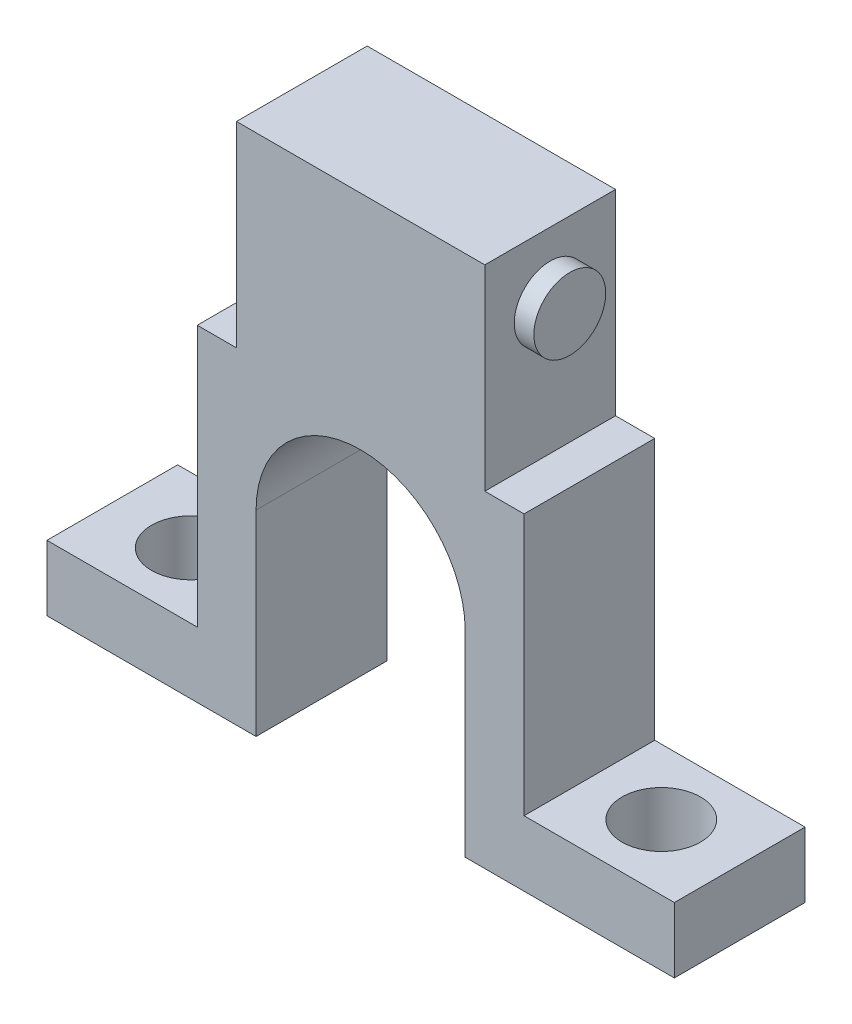
ISO-10303-21;
HEADER;
FILE_DESCRIPTION(('STEP AP214'),'2;1');
FILE_NAME('part.step','',(''),(''),'','','');
FILE_SCHEMA(('AUTOMOTIVE_DESIGN { 1 0 10303 214 1 1 1 1 }'));
ENDSEC;
DATA;
#1=APPLICATION_CONTEXT('core data for automotive mechanical design processes');
#2=APPLICATION_PROTOCOL_DEFINITION('international standard','automotive_design',2000,#1);
#3=PRODUCT_CONTEXT('',#1,'mechanical');
#4=PRODUCT('Part','Part','',(#3));
#5=PRODUCT_RELATED_PRODUCT_CATEGORY('part','',(#4));
#6=PRODUCT_DEFINITION_FORMATION('','',#4);
#7=PRODUCT_DEFINITION_CONTEXT('part definition',#1,'design');
#8=PRODUCT_DEFINITION('design','',#6,#7);
#9=PRODUCT_DEFINITION_SHAPE('','',#8);
#10=(LENGTH_UNIT() NAMED_UNIT(*) SI_UNIT(.MILLI.,.METRE.));
#11=(NAMED_UNIT(*) PLANE_ANGLE_UNIT() SI_UNIT($,.RADIAN.));
#12=(NAMED_UNIT(*) SI_UNIT($,.STERADIAN.) SOLID_ANGLE_UNIT());
#13=UNCERTAINTY_MEASURE_WITH_UNIT(LENGTH_MEASURE(1.E-05),#10,'distance_accuracy_value','');
#14=(GEOMETRIC_REPRESENTATION_CONTEXT(3) GLOBAL_UNCERTAINTY_ASSIGNED_CONTEXT((#13)) GLOBAL_UNIT_ASSIGNED_CONTEXT((#10,
#11,#12)) REPRESENTATION_CONTEXT('',''));
#15=CARTESIAN_POINT('',(0.,0.,0.));
#16=DIRECTION('',(0.,0.,1.));
#17=DIRECTION('',(1.,0.,0.));
#18=AXIS2_PLACEMENT_3D('',#15,#16,#17);
#19=CARTESIAN_POINT('',(0.,-22.5,0.));
#20=DIRECTION('',(0.,-1.,0.));
#21=DIRECTION('',(0.,0.,-1.));
#22=AXIS2_PLACEMENT_3D('',#19,#20,#21);
#23=PLANE('',#22);
#24=DIRECTION('',(0.,0.,1.));
#25=VECTOR('',#24,1.);
#26=CARTESIAN_POINT('',(-8.,-22.5,-5.));
#27=LINE('',#26,#25);
#28=CARTESIAN_POINT('',(-8.,-22.5,-5.));
#29=VERTEX_POINT('',#28);
#30=CARTESIAN_POINT('',(-8.,-22.5,5.));
#31=VERTEX_POINT('',#30);
#32=EDGE_CURVE('E227',#29,#31,#27,.T.);
#33=ORIENTED_EDGE('',*,*,#32,.T.);
#34=DIRECTION('',(-1.,0.,0.));
#35=VECTOR('',#34,1.);
#36=CARTESIAN_POINT('',(-24.,-22.5,5.));
#37=LINE('',#36,#35);
#38=CARTESIAN_POINT('',(-24.,-22.5,5.));
#39=VERTEX_POINT('',#38);
#40=EDGE_CURVE('E246',#31,#39,#37,.T.);
#41=ORIENTED_EDGE('',*,*,#40,.T.);
#42=DIRECTION('',(0.,0.,-1.));
#43=VECTOR('',#42,1.);
#44=CARTESIAN_POINT('',(-24.,-22.5,5.));
#45=LINE('',#44,#43);
#46=CARTESIAN_POINT('',(-24.,-22.5,-5.));
#47=VERTEX_POINT('',#46);
#48=EDGE_CURVE('E235',#39,#47,#45,.T.);
#49=ORIENTED_EDGE('',*,*,#48,.T.);
#50=DIRECTION('',(1.,0.,0.));
#51=VECTOR('',#50,1.);
#52=CARTESIAN_POINT('',(-24.,-22.5,-5.));
#53=LINE('',#52,#51);
#54=EDGE_CURVE('E240',#47,#29,#53,.T.);
#55=ORIENTED_EDGE('',*,*,#54,.T.);
#56=EDGE_LOOP('',(#33,#41,#49,#55));
#57=FACE_BOUND('',#56,.T.);
#58=CARTESIAN_POINT('',(-18.,-22.5,0.));
#59=DIRECTION('',(0.,1.,0.));
#60=DIRECTION('',(0.,0.,1.));
#61=AXIS2_PLACEMENT_3D('',#58,#59,#60);
#62=CIRCLE('',#61,3.);
#63=CARTESIAN_POINT('',(-18.,-22.5,3.));
#64=VERTEX_POINT('',#63);
#65=EDGE_CURVE('E224',#64,#64,#62,.T.);
#66=ORIENTED_EDGE('',*,*,#65,.T.);
#67=EDGE_LOOP('',(#66));
#68=FACE_BOUND('',#67,.T.);
#69=ADVANCED_FACE('F33',(#57,#68),#23,.T.);
#70=CARTESIAN_POINT('',(-9.5,17.5,5.));
#71=DIRECTION('',(1.,0.,0.));
#72=DIRECTION('',(0.,1.,0.));
#73=AXIS2_PLACEMENT_3D('',#70,#71,#72);
#74=PLANE('',#73);
#75=CARTESIAN_POINT('',(-9.5,12.5,0.));
#76=DIRECTION('',(1.,0.,0.));
#77=DIRECTION('',(0.,1.,0.));
#78=AXIS2_PLACEMENT_3D('',#75,#76,#77);
#79=CIRCLE('',#78,2.75);
#80=CARTESIAN_POINT('',(-9.5,15.25,0.));
#81=VERTEX_POINT('',#80);
#82=EDGE_CURVE('E11',#81,#81,#79,.F.);
#83=ORIENTED_EDGE('',*,*,#82,.F.);
#84=EDGE_LOOP('',(#83));
#85=FACE_BOUND('',#84,.T.);
#86=DIRECTION('',(0.,-1.,0.));
#87=VECTOR('',#86,1.);
#88=CARTESIAN_POINT('',(-9.5,17.5,-5.));
#89=LINE('',#88,#87);
#90=CARTESIAN_POINT('',(-9.5,17.5,-5.));
#91=VERTEX_POINT('',#90);
#92=CARTESIAN_POINT('',(-9.5,2.5,-5.));
#93=VERTEX_POINT('',#92);
#94=EDGE_CURVE('E141',#91,#93,#89,.T.);
#95=ORIENTED_EDGE('',*,*,#94,.T.);
#96=DIRECTION('',(0.,0.,-1.));
#97=VECTOR('',#96,1.);
#98=CARTESIAN_POINT('',(-9.5,2.5,5.));
#99=LINE('',#98,#97);
#100=CARTESIAN_POINT('',(-9.5,2.5,5.));
#101=VERTEX_POINT('',#100);
#102=EDGE_CURVE('E167',#101,#93,#99,.T.);
#103=ORIENTED_EDGE('',*,*,#102,.F.);
#104=DIRECTION('',(0.,-1.,0.));
#105=VECTOR('',#104,1.);
#106=CARTESIAN_POINT('',(-9.5,17.5,5.));
#107=LINE('',#106,#105);
#108=CARTESIAN_POINT('',(-9.5,17.5,5.));
#109=VERTEX_POINT('',#108);
#110=EDGE_CURVE('E156',#109,#101,#107,.T.);
#111=ORIENTED_EDGE('',*,*,#110,.F.);
#112=DIRECTION('',(0.,0.,-1.));
#113=VECTOR('',#112,1.);
#114=CARTESIAN_POINT('',(-9.5,17.5,5.));
#115=LINE('',#114,#113);
#116=EDGE_CURVE('E137',#109,#91,#115,.T.);
#117=ORIENTED_EDGE('',*,*,#116,.T.);
#118=EDGE_LOOP('',(#95,#103,#111,#117));
#119=FACE_BOUND('',#118,.T.);
#120=ADVANCED_FACE('F35',(#85,#119),#74,.F.);
#121=CARTESIAN_POINT('',(-9.5,2.5,5.));
#122=DIRECTION('',(0.,-1.,0.));
#123=DIRECTION('',(1.,0.,0.));
#124=AXIS2_PLACEMENT_3D('',#121,#122,#123);
#125=PLANE('',#124);
#126=DIRECTION('',(-1.,0.,0.));
#127=VECTOR('',#126,1.);
#128=CARTESIAN_POINT('',(-9.5,2.5,-5.));
#129=LINE('',#128,#127);
#130=CARTESIAN_POINT('',(-12.5,2.5,-5.));
#131=VERTEX_POINT('',#130);
#132=EDGE_CURVE('E144',#93,#131,#129,.T.);
#133=ORIENTED_EDGE('',*,*,#132,.T.);
#134=DIRECTION('',(0.,0.,-1.));
#135=VECTOR('',#134,1.);
#136=CARTESIAN_POINT('',(-12.5,2.5,5.));
#137=LINE('',#136,#135);
#138=CARTESIAN_POINT('',(-12.5,2.5,5.));
#139=VERTEX_POINT('',#138);
#140=EDGE_CURVE('E165',#139,#131,#137,.T.);
#141=ORIENTED_EDGE('',*,*,#140,.F.);
#142=DIRECTION('',(-1.,0.,0.));
#143=VECTOR('',#142,1.);
#144=CARTESIAN_POINT('',(-9.5,2.5,5.));
#145=LINE('',#144,#143);
#146=EDGE_CURVE('E97',#101,#139,#145,.T.);
#147=ORIENTED_EDGE('',*,*,#146,.F.);
#148=ORIENTED_EDGE('',*,*,#102,.T.);
#149=EDGE_LOOP('',(#133,#141,#147,#148));
#150=FACE_BOUND('',#149,.T.);
#151=ADVANCED_FACE('F191',(#150),#125,.F.);
#152=CARTESIAN_POINT('',(-12.5,2.5,5.));
#153=DIRECTION('',(1.,0.,0.));
#154=DIRECTION('',(0.,1.,0.));
#155=AXIS2_PLACEMENT_3D('',#152,#153,#154);
#156=PLANE('',#155);
#157=DIRECTION('',(0.,-1.,0.));
#158=VECTOR('',#157,1.);
#159=CARTESIAN_POINT('',(-12.5,2.5,-5.));
#160=LINE('',#159,#158);
#161=CARTESIAN_POINT('',(-12.5,-17.5,-5.));
#162=VERTEX_POINT('',#161);
#163=EDGE_CURVE('E147',#131,#162,#160,.T.);
#164=ORIENTED_EDGE('',*,*,#163,.T.);
#165=DIRECTION('',(0.,0.,-1.));
#166=VECTOR('',#165,1.);
#167=CARTESIAN_POINT('',(-12.5,-17.5,5.));
#168=LINE('',#167,#166);
#169=CARTESIAN_POINT('',(-12.5,-17.5,5.));
#170=VERTEX_POINT('',#169);
#171=EDGE_CURVE('E162',#170,#162,#168,.T.);
#172=ORIENTED_EDGE('',*,*,#171,.F.);
#173=DIRECTION('',(0.,-1.,0.));
#174=VECTOR('',#173,1.);
#175=CARTESIAN_POINT('',(-12.5,2.5,5.));
#176=LINE('',#175,#174);
#177=EDGE_CURVE('E279',#139,#170,#176,.T.);
#178=ORIENTED_EDGE('',*,*,#177,.F.);
#179=ORIENTED_EDGE('',*,*,#140,.T.);
#180=EDGE_LOOP('',(#164,#172,#178,#179));
#181=FACE_BOUND('',#180,.T.);
#182=ADVANCED_FACE('F287',(#181),#156,.F.);
#183=CARTESIAN_POINT('',(12.5,2.5,5.));
#184=DIRECTION('',(-1.,0.,0.));
#185=DIRECTION('',(0.,-1.,0.));
#186=AXIS2_PLACEMENT_3D('',#183,#184,#185);
#187=PLANE('',#186);
#188=DIRECTION('',(0.,1.,0.));
#189=VECTOR('',#188,1.);
#190=CARTESIAN_POINT('',(12.5,2.5,-5.));
#191=LINE('',#190,#189);
#192=CARTESIAN_POINT('',(12.5,-17.5,-5.));
#193=VERTEX_POINT('',#192);
#194=CARTESIAN_POINT('',(12.5,2.5,-5.));
#195=VERTEX_POINT('',#194);
#196=EDGE_CURVE('E150',#193,#195,#191,.T.);
#197=ORIENTED_EDGE('',*,*,#196,.T.);
#198=DIRECTION('',(0.,0.,-1.));
#199=VECTOR('',#198,1.);
#200=CARTESIAN_POINT('',(12.5,2.5,5.));
#201=LINE('',#200,#199);
#202=CARTESIAN_POINT('',(12.5,2.5,5.));
#203=VERTEX_POINT('',#202);
#204=EDGE_CURVE('E132',#203,#195,#201,.T.);
#205=ORIENTED_EDGE('',*,*,#204,.F.);
#206=DIRECTION('',(0.,1.,0.));
#207=VECTOR('',#206,1.);
#208=CARTESIAN_POINT('',(12.5,2.5,5.));
#209=LINE('',#208,#207);
#210=CARTESIAN_POINT('',(12.5,-17.5,5.));
#211=VERTEX_POINT('',#210);
#212=EDGE_CURVE('E120',#211,#203,#209,.T.);
#213=ORIENTED_EDGE('',*,*,#212,.F.);
#214=DIRECTION('',(0.,0.,-1.));
#215=VECTOR('',#214,1.);
#216=CARTESIAN_POINT('',(12.5,-17.5,5.));
#217=LINE('',#216,#215);
#218=EDGE_CURVE('E160',#211,#193,#217,.T.);
#219=ORIENTED_EDGE('',*,*,#218,.T.);
#220=EDGE_LOOP('',(#197,#205,#213,#219));
#221=FACE_BOUND('',#220,.T.);
#222=ADVANCED_FACE('F182',(#221),#187,.F.);
#223=CARTESIAN_POINT('',(9.5,2.5,5.));
#224=DIRECTION('',(0.,-1.,0.));
#225=DIRECTION('',(1.,0.,0.));
#226=AXIS2_PLACEMENT_3D('',#223,#224,#225);
#227=PLANE('',#226);
#228=DIRECTION('',(-1.,0.,0.));
#229=VECTOR('',#228,1.);
#230=CARTESIAN_POINT('',(9.5,2.5,-5.));
#231=LINE('',#230,#229);
#232=CARTESIAN_POINT('',(9.5,2.5,-5.));
#233=VERTEX_POINT('',#232);
#234=EDGE_CURVE('E129',#195,#233,#231,.T.);
#235=ORIENTED_EDGE('',*,*,#234,.T.);
#236=DIRECTION('',(0.,0.,-1.));
#237=VECTOR('',#236,1.);
#238=CARTESIAN_POINT('',(9.5,2.5,5.));
#239=LINE('',#238,#237);
#240=CARTESIAN_POINT('',(9.5,2.5,5.));
#241=VERTEX_POINT('',#240);
#242=EDGE_CURVE('E126',#241,#233,#239,.T.);
#243=ORIENTED_EDGE('',*,*,#242,.F.);
#244=DIRECTION('',(-1.,0.,0.));
#245=VECTOR('',#244,1.);
#246=CARTESIAN_POINT('',(9.5,2.5,5.));
#247=LINE('',#246,#245);
#248=EDGE_CURVE('E112',#203,#241,#247,.T.);
#249=ORIENTED_EDGE('',*,*,#248,.F.);
#250=ORIENTED_EDGE('',*,*,#204,.T.);
#251=EDGE_LOOP('',(#235,#243,#249,#250));
#252=FACE_BOUND('',#251,.T.);
#253=ADVANCED_FACE('F127',(#252),#227,.F.);
#254=CARTESIAN_POINT('',(9.5,17.5,5.));
#255=DIRECTION('',(-1.,0.,0.));
#256=DIRECTION('',(0.,-1.,0.));
#257=AXIS2_PLACEMENT_3D('',#254,#255,#256);
#258=PLANE('',#257);
#259=CARTESIAN_POINT('',(9.5,12.5,0.));
#260=DIRECTION('',(-1.,0.,0.));
#261=DIRECTION('',(0.,-1.,0.));
#262=AXIS2_PLACEMENT_3D('',#259,#260,#261);
#263=CIRCLE('',#262,2.75);
#264=CARTESIAN_POINT('',(9.5,9.75,0.));
#265=VERTEX_POINT('',#264);
#266=EDGE_CURVE('E37',#265,#265,#263,.F.);
#267=ORIENTED_EDGE('',*,*,#266,.F.);
#268=EDGE_LOOP('',(#267));
#269=FACE_BOUND('',#268,.T.);
#270=DIRECTION('',(0.,1.,0.));
#271=VECTOR('',#270,1.);
#272=CARTESIAN_POINT('',(9.5,17.5,-5.));
#273=LINE('',#272,#271);
#274=CARTESIAN_POINT('',(9.5,17.5,-5.));
#275=VERTEX_POINT('',#274);
#276=EDGE_CURVE('E153',#233,#275,#273,.T.);
#277=ORIENTED_EDGE('',*,*,#276,.T.);
#278=DIRECTION('',(0.,0.,-1.));
#279=VECTOR('',#278,1.);
#280=CARTESIAN_POINT('',(9.5,17.5,5.));
#281=LINE('',#280,#279);
#282=CARTESIAN_POINT('',(9.5,17.5,5.));
#283=VERTEX_POINT('',#282);
#284=EDGE_CURVE('E133',#283,#275,#281,.T.);
#285=ORIENTED_EDGE('',*,*,#284,.F.);
#286=DIRECTION('',(0.,1.,0.));
#287=VECTOR('',#286,1.);
#288=CARTESIAN_POINT('',(9.5,17.5,5.));
#289=LINE('',#288,#287);
#290=EDGE_CURVE('E117',#241,#283,#289,.T.);
#291=ORIENTED_EDGE('',*,*,#290,.F.);
#292=ORIENTED_EDGE('',*,*,#242,.T.);
#293=EDGE_LOOP('',(#277,#285,#291,#292));
#294=FACE_BOUND('',#293,.T.);
#295=ADVANCED_FACE('F135',(#269,#294),#258,.F.);
#296=CARTESIAN_POINT('',(-9.5,17.5,5.));
#297=DIRECTION('',(0.,-1.,0.));
#298=DIRECTION('',(0.,0.,-1.));
#299=AXIS2_PLACEMENT_3D('',#296,#297,#298);
#300=PLANE('',#299);
#301=DIRECTION('',(-1.,0.,0.));
#302=VECTOR('',#301,1.);
#303=CARTESIAN_POINT('',(-9.5,17.5,-5.));
#304=LINE('',#303,#302);
#305=EDGE_CURVE('E88',#275,#91,#304,.T.);
#306=ORIENTED_EDGE('',*,*,#305,.T.);
#307=ORIENTED_EDGE('',*,*,#116,.F.);
#308=DIRECTION('',(-1.,0.,0.));
#309=VECTOR('',#308,1.);
#310=CARTESIAN_POINT('',(-9.5,17.5,5.));
#311=LINE('',#310,#309);
#312=EDGE_CURVE('E58',#283,#109,#311,.T.);
#313=ORIENTED_EDGE('',*,*,#312,.F.);
#314=ORIENTED_EDGE('',*,*,#284,.T.);
#315=EDGE_LOOP('',(#306,#307,#313,#314));
#316=FACE_BOUND('',#315,.T.);
#317=ADVANCED_FACE('F175',(#316),#300,.F.);
#318=CARTESIAN_POINT('',(0.,0.,5.));
#319=DIRECTION('',(0.,0.,-1.));
#320=DIRECTION('',(-1.,0.,0.));
#321=AXIS2_PLACEMENT_3D('',#318,#319,#320);
#322=PLANE('',#321);
#323=ORIENTED_EDGE('',*,*,#40,.F.);
#324=DIRECTION('',(0.,-1.,0.));
#325=VECTOR('',#324,1.);
#326=CARTESIAN_POINT('',(-8.,-22.5,5.));
#327=LINE('',#326,#325);
#328=CARTESIAN_POINT('',(-8.,-7.5,5.));
#329=VERTEX_POINT('',#328);
#330=EDGE_CURVE('E515',#329,#31,#327,.T.);
#331=ORIENTED_EDGE('',*,*,#330,.F.);
#332=CARTESIAN_POINT('',(0.,-7.5,5.));
#333=DIRECTION('',(0.,0.,1.));
#334=DIRECTION('',(1.,0.,0.));
#335=AXIS2_PLACEMENT_3D('',#332,#333,#334);
#336=CIRCLE('',#335,8.);
#337=CARTESIAN_POINT('',(8.,-7.5,5.));
#338=VERTEX_POINT('',#337);
#339=EDGE_CURVE('E510',#338,#329,#336,.T.);
#340=ORIENTED_EDGE('',*,*,#339,.F.);
#341=DIRECTION('',(0.,1.,0.));
#342=VECTOR('',#341,1.);
#343=CARTESIAN_POINT('',(8.,-22.5,5.));
#344=LINE('',#343,#342);
#345=CARTESIAN_POINT('',(8.,-22.5,5.));
#346=VERTEX_POINT('',#345);
#347=EDGE_CURVE('E501',#346,#338,#344,.T.);
#348=ORIENTED_EDGE('',*,*,#347,.F.);
#349=CARTESIAN_POINT('',(24.,-22.5,5.00000000000001));
#350=VERTEX_POINT('',#349);
#351=EDGE_CURVE('E247',#350,#346,#37,.T.);
#352=ORIENTED_EDGE('',*,*,#351,.F.);
#353=DIRECTION('',(0.,1.,0.));
#354=VECTOR('',#353,1.);
#355=CARTESIAN_POINT('',(24.,-22.5,5.00000000000001));
#356=LINE('',#355,#354);
#357=CARTESIAN_POINT('',(24.,-17.5,5.00000000000001));
#358=VERTEX_POINT('',#357);
#359=EDGE_CURVE('E263',#350,#358,#356,.T.);
#360=ORIENTED_EDGE('',*,*,#359,.T.);
#361=DIRECTION('',(-1.,0.,0.));
#362=VECTOR('',#361,1.);
#363=CARTESIAN_POINT('',(-24.,-17.5,5.));
#364=LINE('',#363,#362);
#365=EDGE_CURVE('E239',#358,#211,#364,.T.);
#366=ORIENTED_EDGE('',*,*,#365,.T.);
#367=ORIENTED_EDGE('',*,*,#212,.T.);
#368=ORIENTED_EDGE('',*,*,#248,.T.);
#369=ORIENTED_EDGE('',*,*,#290,.T.);
#370=ORIENTED_EDGE('',*,*,#312,.T.);
#371=ORIENTED_EDGE('',*,*,#110,.T.);
#372=ORIENTED_EDGE('',*,*,#146,.T.);
#373=ORIENTED_EDGE('',*,*,#177,.T.);
#374=CARTESIAN_POINT('',(-24.,-17.5,5.));
#375=VERTEX_POINT('',#374);
#376=EDGE_CURVE('E259',#170,#375,#364,.T.);
#377=ORIENTED_EDGE('',*,*,#376,.T.);
#378=DIRECTION('',(0.,1.,0.));
#379=VECTOR('',#378,1.);
#380=CARTESIAN_POINT('',(-24.,-22.5,5.));
#381=LINE('',#380,#379);
#382=EDGE_CURVE('E249',#39,#375,#381,.T.);
#383=ORIENTED_EDGE('',*,*,#382,.F.);
#384=EDGE_LOOP('',(#323,#331,#340,#348,#352,#360,#366,#367,#368,#369,#370,#371,#372,#373,#377,#383));
#385=FACE_BOUND('',#384,.T.);
#386=ADVANCED_FACE('F115',(#385),#322,.F.);
#387=CARTESIAN_POINT('',(0.,0.,-5.));
#388=DIRECTION('',(0.,0.,-1.));
#389=DIRECTION('',(-1.,0.,0.));
#390=AXIS2_PLACEMENT_3D('',#387,#388,#389);
#391=PLANE('',#390);
#392=DIRECTION('',(0.,-1.,0.));
#393=VECTOR('',#392,1.);
#394=CARTESIAN_POINT('',(-8.,-22.5,-5.));
#395=LINE('',#394,#393);
#396=CARTESIAN_POINT('',(-8.,-7.5,-5.));
#397=VERTEX_POINT('',#396);
#398=EDGE_CURVE('E524',#397,#29,#395,.T.);
#399=ORIENTED_EDGE('',*,*,#398,.T.);
#400=ORIENTED_EDGE('',*,*,#54,.F.);
#401=DIRECTION('',(0.,1.,0.));
#402=VECTOR('',#401,1.);
#403=CARTESIAN_POINT('',(-24.,-22.5,-5.));
#404=LINE('',#403,#402);
#405=CARTESIAN_POINT('',(-24.,-17.5,-5.));
#406=VERTEX_POINT('',#405);
#407=EDGE_CURVE('E269',#47,#406,#404,.T.);
#408=ORIENTED_EDGE('',*,*,#407,.T.);
#409=DIRECTION('',(1.,0.,0.));
#410=VECTOR('',#409,1.);
#411=CARTESIAN_POINT('',(-24.,-17.5,-5.));
#412=LINE('',#411,#410);
#413=EDGE_CURVE('E253',#406,#162,#412,.T.);
#414=ORIENTED_EDGE('',*,*,#413,.T.);
#415=ORIENTED_EDGE('',*,*,#163,.F.);
#416=ORIENTED_EDGE('',*,*,#132,.F.);
#417=ORIENTED_EDGE('',*,*,#94,.F.);
#418=ORIENTED_EDGE('',*,*,#305,.F.);
#419=ORIENTED_EDGE('',*,*,#276,.F.);
#420=ORIENTED_EDGE('',*,*,#234,.F.);
#421=ORIENTED_EDGE('',*,*,#196,.F.);
#422=CARTESIAN_POINT('',(24.,-17.5,-4.99999999999999));
#423=VERTEX_POINT('',#422);
#424=EDGE_CURVE('E252',#193,#423,#412,.T.);
#425=ORIENTED_EDGE('',*,*,#424,.T.);
#426=DIRECTION('',(0.,1.,0.));
#427=VECTOR('',#426,1.);
#428=CARTESIAN_POINT('',(24.,-22.5,-4.99999999999999));
#429=LINE('',#428,#427);
#430=CARTESIAN_POINT('',(24.,-22.5,-4.99999999999999));
#431=VERTEX_POINT('',#430);
#432=EDGE_CURVE('E266',#431,#423,#429,.T.);
#433=ORIENTED_EDGE('',*,*,#432,.F.);
#434=CARTESIAN_POINT('',(8.00000000000001,-22.5,-5.));
#435=VERTEX_POINT('',#434);
#436=EDGE_CURVE('E238',#435,#431,#53,.T.);
#437=ORIENTED_EDGE('',*,*,#436,.F.);
#438=DIRECTION('',(0.,1.,0.));
#439=VECTOR('',#438,1.);
#440=CARTESIAN_POINT('',(8.,-22.5,-5.));
#441=LINE('',#440,#439);
#442=CARTESIAN_POINT('',(8.,-7.5,-5.));
#443=VERTEX_POINT('',#442);
#444=EDGE_CURVE('E49',#435,#443,#441,.T.);
#445=ORIENTED_EDGE('',*,*,#444,.T.);
#446=CARTESIAN_POINT('',(0.,-7.5,-5.));
#447=DIRECTION('',(0.,0.,1.));
#448=DIRECTION('',(1.,0.,0.));
#449=AXIS2_PLACEMENT_3D('',#446,#447,#448);
#450=CIRCLE('',#449,8.);
#451=EDGE_CURVE('E525',#443,#397,#450,.T.);
#452=ORIENTED_EDGE('',*,*,#451,.T.);
#453=EDGE_LOOP('',(#399,#400,#408,#414,#415,#416,#417,#418,#419,#420,#421,#425,#433,#437,#445,#452));
#454=FACE_BOUND('',#453,.T.);
#455=ADVANCED_FACE('F325',(#454),#391,.T.);
#456=CARTESIAN_POINT('',(11.,12.5,0.));
#457=DIRECTION('',(1.,0.,0.));
#458=DIRECTION('',(0.,0.,-1.));
#459=AXIS2_PLACEMENT_3D('',#456,#457,#458);
#460=PLANE('',#459);
#461=CARTESIAN_POINT('',(11.,12.5,0.));
#462=DIRECTION('',(1.,0.,0.));
#463=DIRECTION('',(0.,0.,-1.));
#464=AXIS2_PLACEMENT_3D('',#461,#462,#463);
#465=CIRCLE('',#464,2.75);
#466=CARTESIAN_POINT('',(11.,12.5,-2.75));
#467=VERTEX_POINT('',#466);
#468=EDGE_CURVE('E145',#467,#467,#465,.T.);
#469=ORIENTED_EDGE('',*,*,#468,.T.);
#470=EDGE_LOOP('',(#469));
#471=FACE_BOUND('',#470,.T.);
#472=ADVANCED_FACE('F370',(#471),#460,.T.);
#473=CARTESIAN_POINT('',(11.,12.5,0.));
#474=DIRECTION('',(-1.,0.,0.));
#475=DIRECTION('',(0.,0.,1.));
#476=AXIS2_PLACEMENT_3D('',#473,#474,#475);
#477=CYLINDRICAL_SURFACE('',#476,2.75);
#478=ORIENTED_EDGE('',*,*,#468,.F.);
#479=EDGE_LOOP('',(#478));
#480=FACE_BOUND('',#479,.T.);
#481=ORIENTED_EDGE('',*,*,#266,.T.);
#482=EDGE_LOOP('',(#481));
#483=FACE_BOUND('',#482,.T.);
#484=ADVANCED_FACE('F172',(#480,#483),#477,.T.);
#485=CARTESIAN_POINT('',(-11.,12.5,0.));
#486=DIRECTION('',(1.,0.,0.));
#487=DIRECTION('',(0.,0.,-1.));
#488=AXIS2_PLACEMENT_3D('',#485,#486,#487);
#489=CIRCLE('',#488,2.75);
#490=CARTESIAN_POINT('',(-11.,12.5,-2.75));
#491=VERTEX_POINT('',#490);
#492=EDGE_CURVE('E272',#491,#491,#489,.T.);
#493=ORIENTED_EDGE('',*,*,#492,.T.);
#494=EDGE_LOOP('',(#493));
#495=FACE_BOUND('',#494,.T.);
#496=ORIENTED_EDGE('',*,*,#82,.T.);
#497=EDGE_LOOP('',(#496));
#498=FACE_BOUND('',#497,.T.);
#499=ADVANCED_FACE('F386',(#495,#498),#477,.T.);
#500=CARTESIAN_POINT('',(-11.,12.5,0.));
#501=DIRECTION('',(1.,0.,0.));
#502=DIRECTION('',(0.,0.,-1.));
#503=AXIS2_PLACEMENT_3D('',#500,#501,#502);
#504=PLANE('',#503);
#505=ORIENTED_EDGE('',*,*,#492,.F.);
#506=EDGE_LOOP('',(#505));
#507=FACE_BOUND('',#506,.T.);
#508=ADVANCED_FACE('F396',(#507),#504,.F.);
#509=CARTESIAN_POINT('',(0.,-17.5,0.));
#510=DIRECTION('',(0.,-1.,0.));
#511=DIRECTION('',(0.,0.,-1.));
#512=AXIS2_PLACEMENT_3D('',#509,#510,#511);
#513=PLANE('',#512);
#514=CARTESIAN_POINT('',(-18.,-17.5,0.));
#515=DIRECTION('',(0.,1.,0.));
#516=DIRECTION('',(0.,0.,1.));
#517=AXIS2_PLACEMENT_3D('',#514,#515,#516);
#518=CIRCLE('',#517,3.);
#519=CARTESIAN_POINT('',(-18.,-17.5,3.));
#520=VERTEX_POINT('',#519);
#521=EDGE_CURVE('E220',#520,#520,#518,.T.);
#522=ORIENTED_EDGE('',*,*,#521,.F.);
#523=EDGE_LOOP('',(#522));
#524=FACE_BOUND('',#523,.T.);
#525=ORIENTED_EDGE('',*,*,#376,.F.);
#526=ORIENTED_EDGE('',*,*,#171,.T.);
#527=ORIENTED_EDGE('',*,*,#413,.F.);
#528=DIRECTION('',(0.,0.,-1.));
#529=VECTOR('',#528,1.);
#530=CARTESIAN_POINT('',(-24.,-17.5,5.));
#531=LINE('',#530,#529);
#532=EDGE_CURVE('E233',#375,#406,#531,.T.);
#533=ORIENTED_EDGE('',*,*,#532,.F.);
#534=EDGE_LOOP('',(#525,#526,#527,#533));
#535=FACE_BOUND('',#534,.T.);
#536=ADVANCED_FACE('F207',(#524,#535),#513,.F.);
#537=CARTESIAN_POINT('',(-24.,-22.5,5.));
#538=DIRECTION('',(1.,0.,0.));
#539=DIRECTION('',(0.,0.,-1.));
#540=AXIS2_PLACEMENT_3D('',#537,#538,#539);
#541=PLANE('',#540);
#542=ORIENTED_EDGE('',*,*,#532,.T.);
#543=ORIENTED_EDGE('',*,*,#407,.F.);
#544=ORIENTED_EDGE('',*,*,#48,.F.);
#545=ORIENTED_EDGE('',*,*,#382,.T.);
#546=EDGE_LOOP('',(#542,#543,#544,#545));
#547=FACE_BOUND('',#546,.T.);
#548=ADVANCED_FACE('F208',(#547),#541,.F.);
#549=CARTESIAN_POINT('',(24.,-22.5,5.00000000000001));
#550=DIRECTION('',(-1.,0.,0.));
#551=DIRECTION('',(0.,0.,1.));
#552=AXIS2_PLACEMENT_3D('',#549,#550,#551);
#553=PLANE('',#552);
#554=DIRECTION('',(0.,0.,1.));
#555=VECTOR('',#554,1.);
#556=CARTESIAN_POINT('',(24.,-17.5,5.00000000000001));
#557=LINE('',#556,#555);
#558=EDGE_CURVE('E256',#423,#358,#557,.T.);
#559=ORIENTED_EDGE('',*,*,#558,.T.);
#560=ORIENTED_EDGE('',*,*,#359,.F.);
#561=DIRECTION('',(0.,0.,1.));
#562=VECTOR('',#561,1.);
#563=CARTESIAN_POINT('',(24.,-22.5,5.00000000000001));
#564=LINE('',#563,#562);
#565=EDGE_CURVE('E243',#431,#350,#564,.T.);
#566=ORIENTED_EDGE('',*,*,#565,.F.);
#567=ORIENTED_EDGE('',*,*,#432,.T.);
#568=EDGE_LOOP('',(#559,#560,#566,#567));
#569=FACE_BOUND('',#568,.T.);
#570=ADVANCED_FACE('F199',(#569),#553,.F.);
#571=DIRECTION('',(0.,0.,1.));
#572=VECTOR('',#571,1.);
#573=CARTESIAN_POINT('',(8.,-22.5,-5.));
#574=LINE('',#573,#572);
#575=EDGE_CURVE('E214',#435,#346,#574,.T.);
#576=ORIENTED_EDGE('',*,*,#575,.F.);
#577=ORIENTED_EDGE('',*,*,#436,.T.);
#578=ORIENTED_EDGE('',*,*,#565,.T.);
#579=ORIENTED_EDGE('',*,*,#351,.T.);
#580=EDGE_LOOP('',(#576,#577,#578,#579));
#581=FACE_BOUND('',#580,.T.);
#582=CARTESIAN_POINT('',(18.,-22.5,0.));
#583=DIRECTION('',(0.,1.,0.));
#584=DIRECTION('',(0.,0.,1.));
#585=AXIS2_PLACEMENT_3D('',#582,#583,#584);
#586=CIRCLE('',#585,3.);
#587=CARTESIAN_POINT('',(18.,-22.5,3.));
#588=VERTEX_POINT('',#587);
#589=EDGE_CURVE('E218',#588,#588,#586,.T.);
#590=ORIENTED_EDGE('',*,*,#589,.T.);
#591=EDGE_LOOP('',(#590));
#592=FACE_BOUND('',#591,.T.);
#593=ADVANCED_FACE('F187',(#581,#592),#23,.T.);
#594=CARTESIAN_POINT('',(18.,-17.5,0.));
#595=DIRECTION('',(0.,1.,0.));
#596=DIRECTION('',(0.,0.,1.));
#597=AXIS2_PLACEMENT_3D('',#594,#595,#596);
#598=CIRCLE('',#597,3.);
#599=CARTESIAN_POINT('',(18.,-17.5,3.));
#600=VERTEX_POINT('',#599);
#601=EDGE_CURVE('E221',#600,#600,#598,.T.);
#602=ORIENTED_EDGE('',*,*,#601,.F.);
#603=EDGE_LOOP('',(#602));
#604=FACE_BOUND('',#603,.T.);
#605=ORIENTED_EDGE('',*,*,#218,.F.);
#606=ORIENTED_EDGE('',*,*,#365,.F.);
#607=ORIENTED_EDGE('',*,*,#558,.F.);
#608=ORIENTED_EDGE('',*,*,#424,.F.);
#609=EDGE_LOOP('',(#605,#606,#607,#608));
#610=FACE_BOUND('',#609,.T.);
#611=ADVANCED_FACE('F198',(#604,#610),#513,.F.);
#612=CARTESIAN_POINT('',(-18.,-22.5,0.));
#613=DIRECTION('',(0.,1.,0.));
#614=DIRECTION('',(0.,0.,1.));
#615=AXIS2_PLACEMENT_3D('',#612,#613,#614);
#616=CYLINDRICAL_SURFACE('',#615,3.);
#617=ORIENTED_EDGE('',*,*,#65,.F.);
#618=EDGE_LOOP('',(#617));
#619=FACE_BOUND('',#618,.T.);
#620=ORIENTED_EDGE('',*,*,#521,.T.);
#621=EDGE_LOOP('',(#620));
#622=FACE_BOUND('',#621,.T.);
#623=ADVANCED_FACE('F205',(#619,#622),#616,.F.);
#624=CARTESIAN_POINT('',(18.,-22.5,0.));
#625=DIRECTION('',(0.,1.,0.));
#626=DIRECTION('',(0.,0.,1.));
#627=AXIS2_PLACEMENT_3D('',#624,#625,#626);
#628=CYLINDRICAL_SURFACE('',#627,3.);
#629=ORIENTED_EDGE('',*,*,#589,.F.);
#630=EDGE_LOOP('',(#629));
#631=FACE_BOUND('',#630,.T.);
#632=ORIENTED_EDGE('',*,*,#601,.T.);
#633=EDGE_LOOP('',(#632));
#634=FACE_BOUND('',#633,.T.);
#635=ADVANCED_FACE('F454',(#631,#634),#628,.F.);
#636=CARTESIAN_POINT('',(-8.,-22.5,-5.));
#637=DIRECTION('',(-1.,0.,0.));
#638=DIRECTION('',(0.,0.,1.));
#639=AXIS2_PLACEMENT_3D('',#636,#637,#638);
#640=PLANE('',#639);
#641=ORIENTED_EDGE('',*,*,#330,.T.);
#642=ORIENTED_EDGE('',*,*,#32,.F.);
#643=ORIENTED_EDGE('',*,*,#398,.F.);
#644=DIRECTION('',(0.,0.,1.));
#645=VECTOR('',#644,1.);
#646=CARTESIAN_POINT('',(-8.,-7.5,-5.));
#647=LINE('',#646,#645);
#648=EDGE_CURVE('E522',#397,#329,#647,.T.);
#649=ORIENTED_EDGE('',*,*,#648,.T.);
#650=EDGE_LOOP('',(#641,#642,#643,#649));
#651=FACE_BOUND('',#650,.T.);
#652=ADVANCED_FACE('F462',(#651),#640,.F.);
#653=CARTESIAN_POINT('',(0.,-7.5,-5.));
#654=DIRECTION('',(0.,0.,1.));
#655=DIRECTION('',(1.,0.,0.));
#656=AXIS2_PLACEMENT_3D('',#653,#654,#655);
#657=CYLINDRICAL_SURFACE('',#656,8.);
#658=ORIENTED_EDGE('',*,*,#339,.T.);
#659=ORIENTED_EDGE('',*,*,#648,.F.);
#660=ORIENTED_EDGE('',*,*,#451,.F.);
#661=DIRECTION('',(0.,0.,1.));
#662=VECTOR('',#661,1.);
#663=CARTESIAN_POINT('',(8.,-7.5,-5.));
#664=LINE('',#663,#662);
#665=EDGE_CURVE('E505',#443,#338,#664,.T.);
#666=ORIENTED_EDGE('',*,*,#665,.T.);
#667=EDGE_LOOP('',(#658,#659,#660,#666));
#668=FACE_BOUND('',#667,.T.);
#669=ADVANCED_FACE('F474',(#668),#657,.F.);
#670=CARTESIAN_POINT('',(8.,-22.5,-5.));
#671=DIRECTION('',(1.,0.,0.));
#672=DIRECTION('',(0.,0.,-1.));
#673=AXIS2_PLACEMENT_3D('',#670,#671,#672);
#674=PLANE('',#673);
#675=ORIENTED_EDGE('',*,*,#347,.T.);
#676=ORIENTED_EDGE('',*,*,#665,.F.);
#677=ORIENTED_EDGE('',*,*,#444,.F.);
#678=ORIENTED_EDGE('',*,*,#575,.T.);
#679=EDGE_LOOP('',(#675,#676,#677,#678));
#680=FACE_BOUND('',#679,.T.);
#681=ADVANCED_FACE('F483',(#680),#674,.F.);
#682=CLOSED_SHELL('',(#69,#120,#151,#182,#222,#253,#295,#317,#386,#455,#472,#484,#499,#508,#536,
#548,#570,#593,#611,#623,#635,#652,#669,#681));
#683=MANIFOLD_SOLID_BREP('B2',#682);
#684=ADVANCED_BREP_SHAPE_REPRESENTATION('',(#18,#683),#14);
#685=SHAPE_DEFINITION_REPRESENTATION(#9,#684);
ENDSEC;
END-ISO-10303-21;
